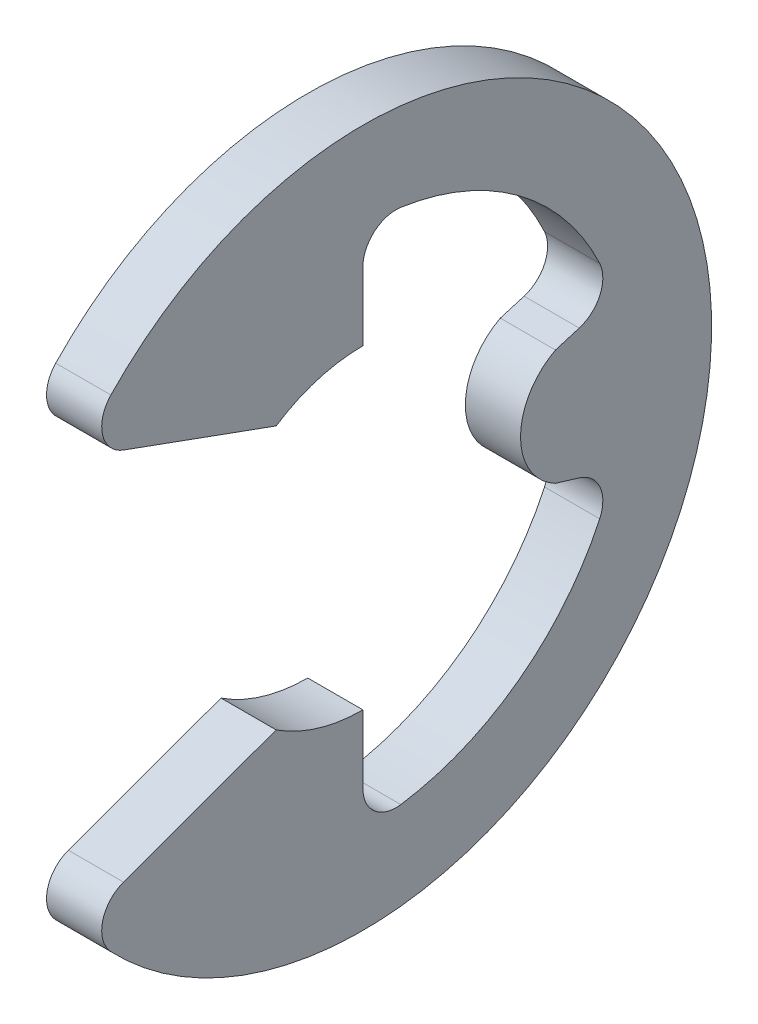
ISO-10303-21;
HEADER;
FILE_DESCRIPTION(('STEP AP214'),'2;1');
FILE_NAME('part.step','',(''),(''),'','','');
FILE_SCHEMA(('AUTOMOTIVE_DESIGN { 1 0 10303 214 1 1 1 1 }'));
ENDSEC;
DATA;
#1=APPLICATION_CONTEXT('core data for automotive mechanical design processes');
#2=APPLICATION_PROTOCOL_DEFINITION('international standard','automotive_design',2000,#1);
#3=PRODUCT_CONTEXT('',#1,'mechanical');
#4=PRODUCT('Part','Part','',(#3));
#5=PRODUCT_RELATED_PRODUCT_CATEGORY('part','',(#4));
#6=PRODUCT_DEFINITION_FORMATION('','',#4);
#7=PRODUCT_DEFINITION_CONTEXT('part definition',#1,'design');
#8=PRODUCT_DEFINITION('design','',#6,#7);
#9=PRODUCT_DEFINITION_SHAPE('','',#8);
#10=(LENGTH_UNIT() NAMED_UNIT(*) SI_UNIT(.MILLI.,.METRE.));
#11=(NAMED_UNIT(*) PLANE_ANGLE_UNIT() SI_UNIT($,.RADIAN.));
#12=(NAMED_UNIT(*) SI_UNIT($,.STERADIAN.) SOLID_ANGLE_UNIT());
#13=UNCERTAINTY_MEASURE_WITH_UNIT(LENGTH_MEASURE(1.E-05),#10,'distance_accuracy_value','');
#14=(GEOMETRIC_REPRESENTATION_CONTEXT(3) GLOBAL_UNCERTAINTY_ASSIGNED_CONTEXT((#13)) GLOBAL_UNIT_ASSIGNED_CONTEXT((#10,
#11,#12)) REPRESENTATION_CONTEXT('',''));
#15=CARTESIAN_POINT('',(0.,0.,0.));
#16=DIRECTION('',(0.,0.,1.));
#17=DIRECTION('',(1.,0.,0.));
#18=AXIS2_PLACEMENT_3D('',#15,#16,#17);
#19=CARTESIAN_POINT('',(0.35,0.,0.));
#20=DIRECTION('',(-1.,0.,0.));
#21=DIRECTION('',(0.,0.,1.));
#22=AXIS2_PLACEMENT_3D('',#19,#20,#21);
#23=CYLINDRICAL_SURFACE('',#22,4.425);
#24=CARTESIAN_POINT('',(0.35,0.,0.));
#25=DIRECTION('',(1.,0.,0.));
#26=DIRECTION('',(0.,0.,-1.));
#27=AXIS2_PLACEMENT_3D('',#24,#25,#26);
#28=CIRCLE('',#27,4.425);
#29=CARTESIAN_POINT('',(0.35,-3.05865617087812,3.19769407985648));
#30=VERTEX_POINT('',#29);
#31=CARTESIAN_POINT('',(0.35,3.05865617087812,3.19769407985648));
#32=VERTEX_POINT('',#31);
#33=EDGE_CURVE('E217',#30,#32,#28,.T.);
#34=ORIENTED_EDGE('',*,*,#33,.F.);
#35=DIRECTION('',(-1.,0.,0.));
#36=VECTOR('',#35,1.);
#37=CARTESIAN_POINT('',(0.35,-3.05865617087812,3.19769407985648));
#38=LINE('',#37,#36);
#39=CARTESIAN_POINT('',(-0.35,-3.05865617087812,3.19769407985648));
#40=VERTEX_POINT('',#39);
#41=EDGE_CURVE('E246',#30,#40,#38,.T.);
#42=ORIENTED_EDGE('',*,*,#41,.T.);
#43=CARTESIAN_POINT('',(-0.35,0.,0.));
#44=DIRECTION('',(1.,0.,0.));
#45=DIRECTION('',(0.,0.,-1.));
#46=AXIS2_PLACEMENT_3D('',#43,#44,#45);
#47=CIRCLE('',#46,4.425);
#48=CARTESIAN_POINT('',(-0.35,3.05865617087812,3.19769407985648));
#49=VERTEX_POINT('',#48);
#50=EDGE_CURVE('E189',#40,#49,#47,.T.);
#51=ORIENTED_EDGE('',*,*,#50,.T.);
#52=DIRECTION('',(-1.,0.,0.));
#53=VECTOR('',#52,1.);
#54=CARTESIAN_POINT('',(0.35,3.05865617087812,3.19769407985648));
#55=LINE('',#54,#53);
#56=EDGE_CURVE('E244',#49,#32,#55,.F.);
#57=ORIENTED_EDGE('',*,*,#56,.T.);
#58=EDGE_LOOP('',(#34,#42,#51,#57));
#59=FACE_BOUND('',#58,.T.);
#60=ADVANCED_FACE('F34',(#59),#23,.T.);
#61=CARTESIAN_POINT('',(0.35,2.57686993371109,3.59727206987959));
#62=DIRECTION('',(0.,0.939919973538393,-0.341394849614909));
#63=DIRECTION('',(0.,0.341394849614909,0.939919973538393));
#64=AXIS2_PLACEMENT_3D('',#61,#62,#63);
#65=PLANE('',#64);
#66=DIRECTION('',(0.,-0.341394849614909,-0.939919973538393));
#67=VECTOR('',#66,1.);
#68=CARTESIAN_POINT('',(0.35,2.57686993371109,3.59727206987959));
#69=LINE('',#68,#67);
#70=CARTESIAN_POINT('',(0.35,2.37357665390865,3.0375699701321));
#71=VERTEX_POINT('',#70);
#72=CARTESIAN_POINT('',(0.35,1.67,1.10049988641526));
#73=VERTEX_POINT('',#72);
#74=EDGE_CURVE('E298',#71,#73,#69,.T.);
#75=ORIENTED_EDGE('',*,*,#74,.F.);
#76=DIRECTION('',(-1.,0.,0.));
#77=VECTOR('',#76,1.);
#78=CARTESIAN_POINT('',(0.35,2.37357665390865,3.0375699701321));
#79=LINE('',#78,#77);
#80=CARTESIAN_POINT('',(-0.35,2.37357665390865,3.0375699701321));
#81=VERTEX_POINT('',#80);
#82=EDGE_CURVE('E259',#71,#81,#79,.T.);
#83=ORIENTED_EDGE('',*,*,#82,.T.);
#84=DIRECTION('',(0.,-0.341394849614909,-0.939919973538393));
#85=VECTOR('',#84,1.);
#86=CARTESIAN_POINT('',(-0.35,2.57686993371109,3.59727206987959));
#87=LINE('',#86,#85);
#88=CARTESIAN_POINT('',(-0.35,1.67,1.10049988641526));
#89=VERTEX_POINT('',#88);
#90=EDGE_CURVE('E192',#81,#89,#87,.T.);
#91=ORIENTED_EDGE('',*,*,#90,.T.);
#92=DIRECTION('',(-1.,0.,0.));
#93=VECTOR('',#92,1.);
#94=CARTESIAN_POINT('',(0.35,1.67,1.10049988641526));
#95=LINE('',#94,#93);
#96=EDGE_CURVE('E226',#73,#89,#95,.T.);
#97=ORIENTED_EDGE('',*,*,#96,.F.);
#98=EDGE_LOOP('',(#75,#83,#91,#97));
#99=FACE_BOUND('',#98,.T.);
#100=ADVANCED_FACE('F322',(#99),#65,.F.);
#101=CARTESIAN_POINT('',(0.35,0.,0.));
#102=DIRECTION('',(-1.,0.,0.));
#103=DIRECTION('',(0.,0.,1.));
#104=AXIS2_PLACEMENT_3D('',#101,#102,#103);
#105=CYLINDRICAL_SURFACE('',#104,2.);
#106=CARTESIAN_POINT('',(-0.35,0.,0.));
#107=DIRECTION('',(-1.,0.,0.));
#108=DIRECTION('',(0.,0.,1.));
#109=AXIS2_PLACEMENT_3D('',#106,#107,#108);
#110=CIRCLE('',#109,2.);
#111=CARTESIAN_POINT('',(-0.35,2.,0.));
#112=VERTEX_POINT('',#111);
#113=EDGE_CURVE('E194',#89,#112,#110,.T.);
#114=ORIENTED_EDGE('',*,*,#113,.T.);
#115=DIRECTION('',(-1.,0.,0.));
#116=VECTOR('',#115,1.);
#117=CARTESIAN_POINT('',(0.35,2.,0.));
#118=LINE('',#117,#116);
#119=CARTESIAN_POINT('',(0.35,2.,0.));
#120=VERTEX_POINT('',#119);
#121=EDGE_CURVE('E223',#120,#112,#118,.T.);
#122=ORIENTED_EDGE('',*,*,#121,.F.);
#123=CARTESIAN_POINT('',(0.35,0.,0.));
#124=DIRECTION('',(-1.,0.,0.));
#125=DIRECTION('',(0.,0.,1.));
#126=AXIS2_PLACEMENT_3D('',#123,#124,#125);
#127=CIRCLE('',#126,2.);
#128=EDGE_CURVE('E300',#73,#120,#127,.T.);
#129=ORIENTED_EDGE('',*,*,#128,.F.);
#130=ORIENTED_EDGE('',*,*,#96,.T.);
#131=EDGE_LOOP('',(#114,#122,#129,#130));
#132=FACE_BOUND('',#131,.T.);
#133=ADVANCED_FACE('F316',(#132),#105,.F.);
#134=CARTESIAN_POINT('',(0.35,2.,0.));
#135=DIRECTION('',(0.,0.,1.));
#136=DIRECTION('',(0.,-1.,0.));
#137=AXIS2_PLACEMENT_3D('',#134,#135,#136);
#138=PLANE('',#137);
#139=DIRECTION('',(0.,1.,0.));
#140=VECTOR('',#139,1.);
#141=CARTESIAN_POINT('',(-0.35,2.,0.));
#142=LINE('',#141,#140);
#143=CARTESIAN_POINT('',(-0.35,2.8655127589121,0.));
#144=VERTEX_POINT('',#143);
#145=EDGE_CURVE('E196',#112,#144,#142,.T.);
#146=ORIENTED_EDGE('',*,*,#145,.T.);
#147=DIRECTION('',(1.,0.,0.));
#148=VECTOR('',#147,1.);
#149=CARTESIAN_POINT('',(0.35,2.8655127589121,0.));
#150=LINE('',#149,#148);
#151=CARTESIAN_POINT('',(0.35,2.8655127589121,0.));
#152=VERTEX_POINT('',#151);
#153=EDGE_CURVE('E242',#144,#152,#150,.T.);
#154=ORIENTED_EDGE('',*,*,#153,.T.);
#155=DIRECTION('',(0.,1.,0.));
#156=VECTOR('',#155,1.);
#157=CARTESIAN_POINT('',(0.35,2.,0.));
#158=LINE('',#157,#156);
#159=EDGE_CURVE('E302',#120,#152,#158,.T.);
#160=ORIENTED_EDGE('',*,*,#159,.F.);
#161=ORIENTED_EDGE('',*,*,#121,.T.);
#162=EDGE_LOOP('',(#146,#154,#160,#161));
#163=FACE_BOUND('',#162,.T.);
#164=ADVANCED_FACE('F314',(#163),#138,.F.);
#165=CARTESIAN_POINT('',(0.35,0.,0.));
#166=DIRECTION('',(-1.,0.,0.));
#167=DIRECTION('',(0.,0.,1.));
#168=AXIS2_PLACEMENT_3D('',#165,#166,#167);
#169=CYLINDRICAL_SURFACE('',#168,3.31612903225806);
#170=CARTESIAN_POINT('',(0.35,0.,0.));
#171=DIRECTION('',(-1.,0.,0.));
#172=DIRECTION('',(0.,0.,-1.));
#173=AXIS2_PLACEMENT_3D('',#170,#171,#172);
#174=CIRCLE('',#173,3.31612903225806);
#175=CARTESIAN_POINT('',(0.35,3.28107275134956,-0.480908888393851));
#176=VERTEX_POINT('',#175);
#177=CARTESIAN_POINT('',(0.35,1.4030608456941,-3.00468501208778));
#178=VERTEX_POINT('',#177);
#179=EDGE_CURVE('E178',#176,#178,#174,.T.);
#180=ORIENTED_EDGE('',*,*,#179,.F.);
#181=DIRECTION('',(-1.,0.,0.));
#182=VECTOR('',#181,1.);
#183=CARTESIAN_POINT('',(0.35,3.28107275134956,-0.480908888393851));
#184=LINE('',#183,#182);
#185=CARTESIAN_POINT('',(-0.35,3.28107275134956,-0.480908888393851));
#186=VERTEX_POINT('',#185);
#187=EDGE_CURVE('E239',#176,#186,#184,.T.);
#188=ORIENTED_EDGE('',*,*,#187,.T.);
#189=CARTESIAN_POINT('',(-0.35,0.,0.));
#190=DIRECTION('',(-1.,0.,0.));
#191=DIRECTION('',(0.,0.,-1.));
#192=AXIS2_PLACEMENT_3D('',#189,#190,#191);
#193=CIRCLE('',#192,3.31612903225806);
#194=CARTESIAN_POINT('',(-0.35,1.4030608456941,-3.00468501208778));
#195=VERTEX_POINT('',#194);
#196=EDGE_CURVE('E199',#186,#195,#193,.T.);
#197=ORIENTED_EDGE('',*,*,#196,.T.);
#198=DIRECTION('',(-1.,0.,0.));
#199=VECTOR('',#198,1.);
#200=CARTESIAN_POINT('',(0.35,1.4030608456941,-3.00468501208778));
#201=LINE('',#200,#199);
#202=EDGE_CURVE('E237',#195,#178,#201,.F.);
#203=ORIENTED_EDGE('',*,*,#202,.T.);
#204=EDGE_LOOP('',(#180,#188,#197,#203));
#205=FACE_BOUND('',#204,.T.);
#206=ADVANCED_FACE('F287',(#205),#169,.F.);
#207=CARTESIAN_POINT('',(0.35,0.574456264653803,-1.9157244060668));
#208=DIRECTION('',(0.,-0.957862203033401,-0.287228132326902));
#209=DIRECTION('',(0.,0.287228132326902,-0.957862203033401));
#210=AXIS2_PLACEMENT_3D('',#207,#208,#209);
#211=PLANE('',#210);
#212=DIRECTION('',(0.,-0.287228132326902,0.957862203033401));
#213=VECTOR('',#212,1.);
#214=CARTESIAN_POINT('',(-0.35,0.574456264653803,-1.9157244060668));
#215=LINE('',#214,#213);
#216=CARTESIAN_POINT('',(-0.35,0.823055877901229,-2.74476636407186));
#217=VERTEX_POINT('',#216);
#218=CARTESIAN_POINT('',(-0.35,0.732594670903467,-2.44309197611421));
#219=VERTEX_POINT('',#218);
#220=EDGE_CURVE('E202',#217,#219,#215,.T.);
#221=ORIENTED_EDGE('',*,*,#220,.T.);
#222=DIRECTION('',(1.,0.,0.));
#223=VECTOR('',#222,1.);
#224=CARTESIAN_POINT('',(-0.35,0.732594670903468,-2.44309197611421));
#225=LINE('',#224,#223);
#226=CARTESIAN_POINT('',(0.35,0.732594670903468,-2.44309197611421));
#227=VERTEX_POINT('',#226);
#228=EDGE_CURVE('E49',#219,#227,#225,.T.);
#229=ORIENTED_EDGE('',*,*,#228,.T.);
#230=DIRECTION('',(0.,-0.287228132326902,0.957862203033401));
#231=VECTOR('',#230,1.);
#232=CARTESIAN_POINT('',(0.35,0.574456264653803,-1.9157244060668));
#233=LINE('',#232,#231);
#234=CARTESIAN_POINT('',(0.35,0.823055877901229,-2.74476636407186));
#235=VERTEX_POINT('',#234);
#236=EDGE_CURVE('E160',#235,#227,#233,.T.);
#237=ORIENTED_EDGE('',*,*,#236,.F.);
#238=DIRECTION('',(1.,0.,0.));
#239=VECTOR('',#238,1.);
#240=CARTESIAN_POINT('',(-0.35,0.823055877901229,-2.74476636407186));
#241=LINE('',#240,#239);
#242=EDGE_CURVE('E263',#235,#217,#241,.F.);
#243=ORIENTED_EDGE('',*,*,#242,.T.);
#244=EDGE_LOOP('',(#221,#229,#237,#243));
#245=FACE_BOUND('',#244,.T.);
#246=ADVANCED_FACE('F292',(#245),#211,.F.);
#247=CARTESIAN_POINT('',(0.35,-0.574456264653803,-1.9157244060668));
#248=DIRECTION('',(0.,0.957862203033401,-0.287228132326901));
#249=DIRECTION('',(0.,0.287228132326901,0.957862203033401));
#250=AXIS2_PLACEMENT_3D('',#247,#248,#249);
#251=PLANE('',#250);
#252=DIRECTION('',(0.,-0.287228132326901,-0.957862203033401));
#253=VECTOR('',#252,1.);
#254=CARTESIAN_POINT('',(0.35,-0.574456264653803,-1.9157244060668));
#255=LINE('',#254,#253);
#256=CARTESIAN_POINT('',(0.35,-0.732594670903467,-2.44309197611421));
#257=VERTEX_POINT('',#256);
#258=CARTESIAN_POINT('',(0.35,-0.823055877901229,-2.74476636407186));
#259=VERTEX_POINT('',#258);
#260=EDGE_CURVE('E57',#257,#259,#255,.T.);
#261=ORIENTED_EDGE('',*,*,#260,.F.);
#262=DIRECTION('',(1.,0.,0.));
#263=VECTOR('',#262,1.);
#264=CARTESIAN_POINT('',(-0.35,-0.732594670903468,-2.44309197611422));
#265=LINE('',#264,#263);
#266=CARTESIAN_POINT('',(-0.35,-0.732594670903467,-2.44309197611421));
#267=VERTEX_POINT('',#266);
#268=EDGE_CURVE('E164',#257,#267,#265,.F.);
#269=ORIENTED_EDGE('',*,*,#268,.T.);
#270=DIRECTION('',(0.,-0.287228132326901,-0.957862203033401));
#271=VECTOR('',#270,1.);
#272=CARTESIAN_POINT('',(-0.35,-0.574456264653803,-1.9157244060668));
#273=LINE('',#272,#271);
#274=CARTESIAN_POINT('',(-0.35,-0.823055877901229,-2.74476636407186));
#275=VERTEX_POINT('',#274);
#276=EDGE_CURVE('E205',#267,#275,#273,.T.);
#277=ORIENTED_EDGE('',*,*,#276,.T.);
#278=DIRECTION('',(1.,0.,0.));
#279=VECTOR('',#278,1.);
#280=CARTESIAN_POINT('',(0.35,-0.823055877901229,-2.74476636407186));
#281=LINE('',#280,#279);
#282=EDGE_CURVE('E171',#275,#259,#281,.T.);
#283=ORIENTED_EDGE('',*,*,#282,.T.);
#284=EDGE_LOOP('',(#261,#269,#277,#283));
#285=FACE_BOUND('',#284,.T.);
#286=ADVANCED_FACE('F169',(#285),#251,.F.);
#287=CARTESIAN_POINT('',(0.35,0.,0.));
#288=DIRECTION('',(-1.,0.,0.));
#289=DIRECTION('',(0.,0.,1.));
#290=AXIS2_PLACEMENT_3D('',#287,#288,#289);
#291=CYLINDRICAL_SURFACE('',#290,3.31612903225806);
#292=CARTESIAN_POINT('',(-0.35,0.,0.));
#293=DIRECTION('',(-1.,0.,0.));
#294=DIRECTION('',(0.,0.,-1.));
#295=AXIS2_PLACEMENT_3D('',#292,#293,#294);
#296=CIRCLE('',#295,3.31612903225806);
#297=CARTESIAN_POINT('',(-0.35,-1.4030608456941,-3.00468501208778));
#298=VERTEX_POINT('',#297);
#299=CARTESIAN_POINT('',(-0.35,-3.28107275134956,-0.480908888393852));
#300=VERTEX_POINT('',#299);
#301=EDGE_CURVE('E207',#298,#300,#296,.T.);
#302=ORIENTED_EDGE('',*,*,#301,.T.);
#303=DIRECTION('',(-1.,0.,0.));
#304=VECTOR('',#303,1.);
#305=CARTESIAN_POINT('',(0.35,-3.28107275134956,-0.480908888393852));
#306=LINE('',#305,#304);
#307=CARTESIAN_POINT('',(0.35,-3.28107275134956,-0.480908888393852));
#308=VERTEX_POINT('',#307);
#309=EDGE_CURVE('E235',#300,#308,#306,.F.);
#310=ORIENTED_EDGE('',*,*,#309,.T.);
#311=CARTESIAN_POINT('',(0.35,0.,0.));
#312=DIRECTION('',(-1.,0.,0.));
#313=DIRECTION('',(0.,0.,-1.));
#314=AXIS2_PLACEMENT_3D('',#311,#312,#313);
#315=CIRCLE('',#314,3.31612903225806);
#316=CARTESIAN_POINT('',(0.35,-1.4030608456941,-3.00468501208778));
#317=VERTEX_POINT('',#316);
#318=EDGE_CURVE('E173',#317,#308,#315,.T.);
#319=ORIENTED_EDGE('',*,*,#318,.F.);
#320=DIRECTION('',(-1.,0.,0.));
#321=VECTOR('',#320,1.);
#322=CARTESIAN_POINT('',(0.35,-1.4030608456941,-3.00468501208778));
#323=LINE('',#322,#321);
#324=EDGE_CURVE('E232',#317,#298,#323,.T.);
#325=ORIENTED_EDGE('',*,*,#324,.T.);
#326=EDGE_LOOP('',(#302,#310,#319,#325));
#327=FACE_BOUND('',#326,.T.);
#328=ADVANCED_FACE('F357',(#327),#291,.F.);
#329=CARTESIAN_POINT('',(0.35,-2.,0.));
#330=DIRECTION('',(0.,0.,1.));
#331=DIRECTION('',(0.,-1.,0.));
#332=AXIS2_PLACEMENT_3D('',#329,#330,#331);
#333=PLANE('',#332);
#334=DIRECTION('',(0.,1.,0.));
#335=VECTOR('',#334,1.);
#336=CARTESIAN_POINT('',(0.35,-2.,0.));
#337=LINE('',#336,#335);
#338=CARTESIAN_POINT('',(0.35,-2.8655127589121,0.));
#339=VERTEX_POINT('',#338);
#340=CARTESIAN_POINT('',(0.35,-2.,0.));
#341=VERTEX_POINT('',#340);
#342=EDGE_CURVE('E176',#339,#341,#337,.T.);
#343=ORIENTED_EDGE('',*,*,#342,.F.);
#344=DIRECTION('',(1.,0.,0.));
#345=VECTOR('',#344,1.);
#346=CARTESIAN_POINT('',(-0.35,-2.8655127589121,0.));
#347=LINE('',#346,#345);
#348=CARTESIAN_POINT('',(-0.35,-2.8655127589121,0.));
#349=VERTEX_POINT('',#348);
#350=EDGE_CURVE('E229',#339,#349,#347,.F.);
#351=ORIENTED_EDGE('',*,*,#350,.T.);
#352=DIRECTION('',(0.,1.,0.));
#353=VECTOR('',#352,1.);
#354=CARTESIAN_POINT('',(-0.35,-2.,0.));
#355=LINE('',#354,#353);
#356=CARTESIAN_POINT('',(-0.35,-2.,0.));
#357=VERTEX_POINT('',#356);
#358=EDGE_CURVE('E210',#349,#357,#355,.T.);
#359=ORIENTED_EDGE('',*,*,#358,.T.);
#360=DIRECTION('',(-1.,0.,0.));
#361=VECTOR('',#360,1.);
#362=CARTESIAN_POINT('',(0.35,-2.,0.));
#363=LINE('',#362,#361);
#364=EDGE_CURVE('E220',#341,#357,#363,.T.);
#365=ORIENTED_EDGE('',*,*,#364,.F.);
#366=EDGE_LOOP('',(#343,#351,#359,#365));
#367=FACE_BOUND('',#366,.T.);
#368=ADVANCED_FACE('F349',(#367),#333,.F.);
#369=CARTESIAN_POINT('',(0.35,0.,0.));
#370=DIRECTION('',(-1.,0.,0.));
#371=DIRECTION('',(0.,0.,1.));
#372=AXIS2_PLACEMENT_3D('',#369,#370,#371);
#373=CYLINDRICAL_SURFACE('',#372,2.);
#374=CARTESIAN_POINT('',(-0.35,0.,0.));
#375=DIRECTION('',(-1.,0.,0.));
#376=DIRECTION('',(0.,0.,-1.));
#377=AXIS2_PLACEMENT_3D('',#374,#375,#376);
#378=CIRCLE('',#377,2.);
#379=CARTESIAN_POINT('',(-0.35,-1.67,1.10049988641526));
#380=VERTEX_POINT('',#379);
#381=EDGE_CURVE('E212',#357,#380,#378,.T.);
#382=ORIENTED_EDGE('',*,*,#381,.T.);
#383=DIRECTION('',(-1.,0.,0.));
#384=VECTOR('',#383,1.);
#385=CARTESIAN_POINT('',(0.35,-1.67,1.10049988641526));
#386=LINE('',#385,#384);
#387=CARTESIAN_POINT('',(0.35,-1.67,1.10049988641526));
#388=VERTEX_POINT('',#387);
#389=EDGE_CURVE('E188',#388,#380,#386,.T.);
#390=ORIENTED_EDGE('',*,*,#389,.F.);
#391=CARTESIAN_POINT('',(0.35,0.,0.));
#392=DIRECTION('',(-1.,0.,0.));
#393=DIRECTION('',(0.,0.,-1.));
#394=AXIS2_PLACEMENT_3D('',#391,#392,#393);
#395=CIRCLE('',#394,2.);
#396=EDGE_CURVE('E183',#341,#388,#395,.T.);
#397=ORIENTED_EDGE('',*,*,#396,.F.);
#398=ORIENTED_EDGE('',*,*,#364,.T.);
#399=EDGE_LOOP('',(#382,#390,#397,#398));
#400=FACE_BOUND('',#399,.T.);
#401=ADVANCED_FACE('F343',(#400),#373,.F.);
#402=CARTESIAN_POINT('',(0.35,-2.57686993371109,3.59727206987959));
#403=DIRECTION('',(0.,-0.939919973538393,-0.34139484961491));
#404=DIRECTION('',(0.,0.34139484961491,-0.939919973538393));
#405=AXIS2_PLACEMENT_3D('',#402,#403,#404);
#406=PLANE('',#405);
#407=DIRECTION('',(0.,-0.34139484961491,0.939919973538393));
#408=VECTOR('',#407,1.);
#409=CARTESIAN_POINT('',(-0.35,-2.57686993371109,3.59727206987959));
#410=LINE('',#409,#408);
#411=CARTESIAN_POINT('',(-0.35,-2.37357665390865,3.0375699701321));
#412=VERTEX_POINT('',#411);
#413=EDGE_CURVE('E214',#380,#412,#410,.T.);
#414=ORIENTED_EDGE('',*,*,#413,.T.);
#415=DIRECTION('',(-1.,0.,0.));
#416=VECTOR('',#415,1.);
#417=CARTESIAN_POINT('',(0.35,-2.37357665390865,3.0375699701321));
#418=LINE('',#417,#416);
#419=CARTESIAN_POINT('',(0.35,-2.37357665390865,3.0375699701321));
#420=VERTEX_POINT('',#419);
#421=EDGE_CURVE('E253',#412,#420,#418,.F.);
#422=ORIENTED_EDGE('',*,*,#421,.T.);
#423=DIRECTION('',(0.,-0.34139484961491,0.939919973538393));
#424=VECTOR('',#423,1.);
#425=CARTESIAN_POINT('',(0.35,-2.57686993371109,3.59727206987959));
#426=LINE('',#425,#424);
#427=EDGE_CURVE('E185',#388,#420,#426,.T.);
#428=ORIENTED_EDGE('',*,*,#427,.F.);
#429=ORIENTED_EDGE('',*,*,#389,.T.);
#430=EDGE_LOOP('',(#414,#422,#428,#429));
#431=FACE_BOUND('',#430,.T.);
#432=ADVANCED_FACE('F339',(#431),#406,.F.);
#433=CARTESIAN_POINT('',(0.35,0.,0.));
#434=DIRECTION('',(1.,0.,0.));
#435=DIRECTION('',(0.,0.,-1.));
#436=AXIS2_PLACEMENT_3D('',#433,#434,#435);
#437=PLANE('',#436);
#438=CARTESIAN_POINT('',(0.35,0.,-2.82717075759459));
#439=DIRECTION('',(1.,0.,0.));
#440=DIRECTION('',(0.,0.,-1.));
#441=AXIS2_PLACEMENT_3D('',#438,#439,#440);
#442=CIRCLE('',#441,0.827170757594592);
#443=EDGE_CURVE('E156',#257,#227,#442,.F.);
#444=ORIENTED_EDGE('',*,*,#443,.F.);
#445=ORIENTED_EDGE('',*,*,#260,.T.);
#446=CARTESIAN_POINT('',(0.35,-1.22535800317526,-2.62413054849456));
#447=DIRECTION('',(1.,0.,0.));
#448=DIRECTION('',(0.,0.,-1.));
#449=AXIS2_PLACEMENT_3D('',#446,#447,#448);
#450=CIRCLE('',#449,0.42);
#451=EDGE_CURVE('E277',#259,#317,#450,.F.);
#452=ORIENTED_EDGE('',*,*,#451,.T.);
#453=ORIENTED_EDGE('',*,*,#318,.T.);
#454=CARTESIAN_POINT('',(0.35,-2.8655127589121,-0.42));
#455=DIRECTION('',(1.,0.,0.));
#456=DIRECTION('',(0.,0.,-1.));
#457=AXIS2_PLACEMENT_3D('',#454,#455,#456);
#458=CIRCLE('',#457,0.42);
#459=EDGE_CURVE('E268',#308,#339,#458,.F.);
#460=ORIENTED_EDGE('',*,*,#459,.T.);
#461=ORIENTED_EDGE('',*,*,#342,.T.);
#462=ORIENTED_EDGE('',*,*,#396,.T.);
#463=ORIENTED_EDGE('',*,*,#427,.T.);
#464=CARTESIAN_POINT('',(0.35,-2.76834304279478,2.89418413329383));
#465=DIRECTION('',(1.,0.,0.));
#466=DIRECTION('',(0.,0.,-1.));
#467=AXIS2_PLACEMENT_3D('',#464,#465,#466);
#468=CIRCLE('',#467,0.42);
#469=EDGE_CURVE('E257',#420,#30,#468,.T.);
#470=ORIENTED_EDGE('',*,*,#469,.T.);
#471=ORIENTED_EDGE('',*,*,#33,.T.);
#472=CARTESIAN_POINT('',(0.35,2.76834304279477,2.89418413329383));
#473=DIRECTION('',(1.,0.,0.));
#474=DIRECTION('',(0.,0.,-1.));
#475=AXIS2_PLACEMENT_3D('',#472,#473,#474);
#476=CIRCLE('',#475,0.42);
#477=EDGE_CURVE('E255',#32,#71,#476,.T.);
#478=ORIENTED_EDGE('',*,*,#477,.T.);
#479=ORIENTED_EDGE('',*,*,#74,.T.);
#480=ORIENTED_EDGE('',*,*,#128,.T.);
#481=ORIENTED_EDGE('',*,*,#159,.T.);
#482=CARTESIAN_POINT('',(0.35,2.8655127589121,-0.419999999999999));
#483=DIRECTION('',(1.,0.,0.));
#484=DIRECTION('',(0.,0.,-1.));
#485=AXIS2_PLACEMENT_3D('',#482,#483,#484);
#486=CIRCLE('',#485,0.42);
#487=EDGE_CURVE('E272',#152,#176,#486,.F.);
#488=ORIENTED_EDGE('',*,*,#487,.T.);
#489=ORIENTED_EDGE('',*,*,#179,.T.);
#490=CARTESIAN_POINT('',(0.35,1.22535800317526,-2.62413054849456));
#491=DIRECTION('',(1.,0.,0.));
#492=DIRECTION('',(0.,0.,-1.));
#493=AXIS2_PLACEMENT_3D('',#490,#491,#492);
#494=CIRCLE('',#493,0.42);
#495=EDGE_CURVE('E11',#178,#235,#494,.F.);
#496=ORIENTED_EDGE('',*,*,#495,.T.);
#497=ORIENTED_EDGE('',*,*,#236,.T.);
#498=EDGE_LOOP('',(#444,#445,#452,#453,#460,#461,#462,#463,#470,#471,#478,#479,#480,#481,#488,
#489,#496,#497));
#499=FACE_BOUND('',#498,.T.);
#500=ADVANCED_FACE('F158',(#499),#437,.T.);
#501=CARTESIAN_POINT('',(-0.35,0.,0.));
#502=DIRECTION('',(1.,0.,0.));
#503=DIRECTION('',(0.,0.,-1.));
#504=AXIS2_PLACEMENT_3D('',#501,#502,#503);
#505=PLANE('',#504);
#506=ORIENTED_EDGE('',*,*,#276,.F.);
#507=CARTESIAN_POINT('',(-0.35,0.,-2.82717075759459));
#508=DIRECTION('',(1.,0.,0.));
#509=DIRECTION('',(0.,0.,-1.));
#510=AXIS2_PLACEMENT_3D('',#507,#508,#509);
#511=CIRCLE('',#510,0.827170757594592);
#512=EDGE_CURVE('E161',#267,#219,#511,.F.);
#513=ORIENTED_EDGE('',*,*,#512,.T.);
#514=ORIENTED_EDGE('',*,*,#220,.F.);
#515=CARTESIAN_POINT('',(-0.35,1.22535800317526,-2.62413054849456));
#516=DIRECTION('',(1.,0.,0.));
#517=DIRECTION('',(0.,0.,-1.));
#518=AXIS2_PLACEMENT_3D('',#515,#516,#517);
#519=CIRCLE('',#518,0.42);
#520=EDGE_CURVE('E42',#217,#195,#519,.T.);
#521=ORIENTED_EDGE('',*,*,#520,.T.);
#522=ORIENTED_EDGE('',*,*,#196,.F.);
#523=CARTESIAN_POINT('',(-0.35,2.8655127589121,-0.419999999999999));
#524=DIRECTION('',(1.,0.,0.));
#525=DIRECTION('',(0.,0.,-1.));
#526=AXIS2_PLACEMENT_3D('',#523,#524,#525);
#527=CIRCLE('',#526,0.42);
#528=EDGE_CURVE('E270',#186,#144,#527,.T.);
#529=ORIENTED_EDGE('',*,*,#528,.T.);
#530=ORIENTED_EDGE('',*,*,#145,.F.);
#531=ORIENTED_EDGE('',*,*,#113,.F.);
#532=ORIENTED_EDGE('',*,*,#90,.F.);
#533=CARTESIAN_POINT('',(-0.35,2.76834304279477,2.89418413329383));
#534=DIRECTION('',(1.,0.,0.));
#535=DIRECTION('',(0.,0.,-1.));
#536=AXIS2_PLACEMENT_3D('',#533,#534,#535);
#537=CIRCLE('',#536,0.42);
#538=EDGE_CURVE('E249',#81,#49,#537,.F.);
#539=ORIENTED_EDGE('',*,*,#538,.T.);
#540=ORIENTED_EDGE('',*,*,#50,.F.);
#541=CARTESIAN_POINT('',(-0.35,-2.76834304279478,2.89418413329383));
#542=DIRECTION('',(1.,0.,0.));
#543=DIRECTION('',(0.,0.,-1.));
#544=AXIS2_PLACEMENT_3D('',#541,#542,#543);
#545=CIRCLE('',#544,0.42);
#546=EDGE_CURVE('E251',#40,#412,#545,.F.);
#547=ORIENTED_EDGE('',*,*,#546,.T.);
#548=ORIENTED_EDGE('',*,*,#413,.F.);
#549=ORIENTED_EDGE('',*,*,#381,.F.);
#550=ORIENTED_EDGE('',*,*,#358,.F.);
#551=CARTESIAN_POINT('',(-0.35,-2.8655127589121,-0.42));
#552=DIRECTION('',(1.,0.,0.));
#553=DIRECTION('',(0.,0.,-1.));
#554=AXIS2_PLACEMENT_3D('',#551,#552,#553);
#555=CIRCLE('',#554,0.42);
#556=EDGE_CURVE('E266',#349,#300,#555,.T.);
#557=ORIENTED_EDGE('',*,*,#556,.T.);
#558=ORIENTED_EDGE('',*,*,#301,.F.);
#559=CARTESIAN_POINT('',(-0.35,-1.22535800317526,-2.62413054849456));
#560=DIRECTION('',(1.,0.,0.));
#561=DIRECTION('',(0.,0.,-1.));
#562=AXIS2_PLACEMENT_3D('',#559,#560,#561);
#563=CIRCLE('',#562,0.42);
#564=EDGE_CURVE('E274',#298,#275,#563,.T.);
#565=ORIENTED_EDGE('',*,*,#564,.T.);
#566=EDGE_LOOP('',(#506,#513,#514,#521,#522,#529,#530,#531,#532,#539,#540,#547,#548,#549,#550,
#557,#558,#565));
#567=FACE_BOUND('',#566,.T.);
#568=ADVANCED_FACE('F281',(#567),#505,.F.);
#569=CARTESIAN_POINT('',(0.35,-2.8655127589121,-0.42));
#570=DIRECTION('',(-1.,0.,0.));
#571=DIRECTION('',(0.,0.,1.));
#572=AXIS2_PLACEMENT_3D('',#569,#570,#571);
#573=CYLINDRICAL_SURFACE('',#572,0.42);
#574=ORIENTED_EDGE('',*,*,#459,.F.);
#575=ORIENTED_EDGE('',*,*,#309,.F.);
#576=ORIENTED_EDGE('',*,*,#556,.F.);
#577=ORIENTED_EDGE('',*,*,#350,.F.);
#578=EDGE_LOOP('',(#574,#575,#576,#577));
#579=FACE_BOUND('',#578,.T.);
#580=ADVANCED_FACE('F353',(#579),#573,.F.);
#581=CARTESIAN_POINT('',(0.35,2.8655127589121,-0.419999999999999));
#582=DIRECTION('',(-1.,0.,0.));
#583=DIRECTION('',(0.,0.,1.));
#584=AXIS2_PLACEMENT_3D('',#581,#582,#583);
#585=CYLINDRICAL_SURFACE('',#584,0.42);
#586=ORIENTED_EDGE('',*,*,#487,.F.);
#587=ORIENTED_EDGE('',*,*,#153,.F.);
#588=ORIENTED_EDGE('',*,*,#528,.F.);
#589=ORIENTED_EDGE('',*,*,#187,.F.);
#590=EDGE_LOOP('',(#586,#587,#588,#589));
#591=FACE_BOUND('',#590,.T.);
#592=ADVANCED_FACE('F311',(#591),#585,.F.);
#593=CARTESIAN_POINT('',(0.35,-2.76834304279478,2.89418413329383));
#594=DIRECTION('',(-1.,0.,0.));
#595=DIRECTION('',(0.,0.,1.));
#596=AXIS2_PLACEMENT_3D('',#593,#594,#595);
#597=CYLINDRICAL_SURFACE('',#596,0.42);
#598=ORIENTED_EDGE('',*,*,#469,.F.);
#599=ORIENTED_EDGE('',*,*,#421,.F.);
#600=ORIENTED_EDGE('',*,*,#546,.F.);
#601=ORIENTED_EDGE('',*,*,#41,.F.);
#602=EDGE_LOOP('',(#598,#599,#600,#601));
#603=FACE_BOUND('',#602,.T.);
#604=ADVANCED_FACE('F335',(#603),#597,.T.);
#605=CARTESIAN_POINT('',(0.35,2.76834304279477,2.89418413329383));
#606=DIRECTION('',(-1.,0.,0.));
#607=DIRECTION('',(0.,0.,1.));
#608=AXIS2_PLACEMENT_3D('',#605,#606,#607);
#609=CYLINDRICAL_SURFACE('',#608,0.42);
#610=ORIENTED_EDGE('',*,*,#477,.F.);
#611=ORIENTED_EDGE('',*,*,#56,.F.);
#612=ORIENTED_EDGE('',*,*,#538,.F.);
#613=ORIENTED_EDGE('',*,*,#82,.F.);
#614=EDGE_LOOP('',(#610,#611,#612,#613));
#615=FACE_BOUND('',#614,.T.);
#616=ADVANCED_FACE('F326',(#615),#609,.T.);
#617=CARTESIAN_POINT('',(0.35,-1.22535800317526,-2.62413054849456));
#618=DIRECTION('',(-1.,0.,0.));
#619=DIRECTION('',(0.,0.,1.));
#620=AXIS2_PLACEMENT_3D('',#617,#618,#619);
#621=CYLINDRICAL_SURFACE('',#620,0.42);
#622=ORIENTED_EDGE('',*,*,#451,.F.);
#623=ORIENTED_EDGE('',*,*,#282,.F.);
#624=ORIENTED_EDGE('',*,*,#564,.F.);
#625=ORIENTED_EDGE('',*,*,#324,.F.);
#626=EDGE_LOOP('',(#622,#623,#624,#625));
#627=FACE_BOUND('',#626,.T.);
#628=ADVANCED_FACE('F360',(#627),#621,.F.);
#629=CARTESIAN_POINT('',(0.35,1.22535800317526,-2.62413054849456));
#630=DIRECTION('',(-1.,0.,0.));
#631=DIRECTION('',(0.,0.,1.));
#632=AXIS2_PLACEMENT_3D('',#629,#630,#631);
#633=CYLINDRICAL_SURFACE('',#632,0.42);
#634=ORIENTED_EDGE('',*,*,#495,.F.);
#635=ORIENTED_EDGE('',*,*,#202,.F.);
#636=ORIENTED_EDGE('',*,*,#520,.F.);
#637=ORIENTED_EDGE('',*,*,#242,.F.);
#638=EDGE_LOOP('',(#634,#635,#636,#637));
#639=FACE_BOUND('',#638,.T.);
#640=ADVANCED_FACE('F36',(#639),#633,.F.);
#641=CARTESIAN_POINT('',(-0.35,0.,-2.82717075759459));
#642=DIRECTION('',(1.,0.,0.));
#643=DIRECTION('',(0.,0.,-1.));
#644=AXIS2_PLACEMENT_3D('',#641,#642,#643);
#645=CYLINDRICAL_SURFACE('',#644,0.827170757594592);
#646=ORIENTED_EDGE('',*,*,#512,.F.);
#647=ORIENTED_EDGE('',*,*,#268,.F.);
#648=ORIENTED_EDGE('',*,*,#443,.T.);
#649=ORIENTED_EDGE('',*,*,#228,.F.);
#650=EDGE_LOOP('',(#646,#647,#648,#649));
#651=FACE_BOUND('',#650,.T.);
#652=ADVANCED_FACE('F165',(#651),#645,.T.);
#653=CLOSED_SHELL('',(#60,#100,#133,#164,#206,#246,#286,#328,#368,#401,#432,#500,#568,#580,#592,
#604,#616,#628,#640,#652));
#654=MANIFOLD_SOLID_BREP('B2',#653);
#655=ADVANCED_BREP_SHAPE_REPRESENTATION('',(#18,#654),#14);
#656=SHAPE_DEFINITION_REPRESENTATION(#9,#655);
ENDSEC;
END-ISO-10303-21;
